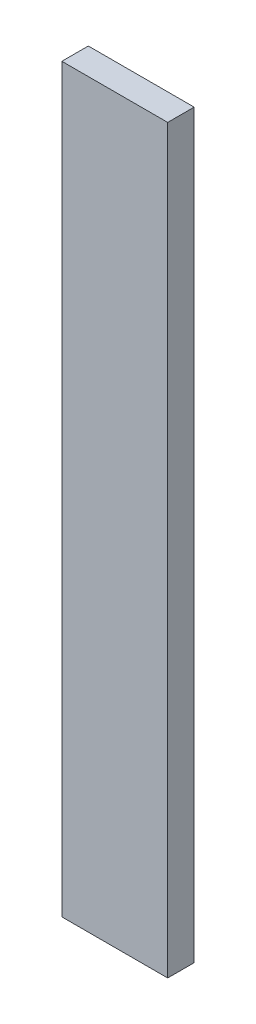
ISO-10303-21;
HEADER;
FILE_DESCRIPTION(('STEP AP214'),'2;1');
FILE_NAME('part.step','',(''),(''),'','','');
FILE_SCHEMA(('AUTOMOTIVE_DESIGN { 1 0 10303 214 1 1 1 1 }'));
ENDSEC;
DATA;
#1=APPLICATION_CONTEXT('core data for automotive mechanical design processes');
#2=APPLICATION_PROTOCOL_DEFINITION('international standard','automotive_design',2000,#1);
#3=PRODUCT_CONTEXT('',#1,'mechanical');
#4=PRODUCT('Part','Part','',(#3));
#5=PRODUCT_RELATED_PRODUCT_CATEGORY('part','',(#4));
#6=PRODUCT_DEFINITION_FORMATION('','',#4);
#7=PRODUCT_DEFINITION_CONTEXT('part definition',#1,'design');
#8=PRODUCT_DEFINITION('design','',#6,#7);
#9=PRODUCT_DEFINITION_SHAPE('','',#8);
#10=(LENGTH_UNIT() NAMED_UNIT(*) SI_UNIT(.MILLI.,.METRE.));
#11=(NAMED_UNIT(*) PLANE_ANGLE_UNIT() SI_UNIT($,.RADIAN.));
#12=(NAMED_UNIT(*) SI_UNIT($,.STERADIAN.) SOLID_ANGLE_UNIT());
#13=UNCERTAINTY_MEASURE_WITH_UNIT(LENGTH_MEASURE(1.E-05),#10,'distance_accuracy_value','');
#14=(GEOMETRIC_REPRESENTATION_CONTEXT(3) GLOBAL_UNCERTAINTY_ASSIGNED_CONTEXT((#13)) GLOBAL_UNIT_ASSIGNED_CONTEXT((#10,
#11,#12)) REPRESENTATION_CONTEXT('',''));
#15=CARTESIAN_POINT('',(0.,0.,0.));
#16=DIRECTION('',(0.,0.,1.));
#17=DIRECTION('',(1.,0.,0.));
#18=AXIS2_PLACEMENT_3D('',#15,#16,#17);
#19=CARTESIAN_POINT('',(12.7,88.9,6.35));
#20=DIRECTION('',(-1.,0.,0.));
#21=DIRECTION('',(0.,-1.,0.));
#22=AXIS2_PLACEMENT_3D('',#19,#20,#21);
#23=PLANE('',#22);
#24=DIRECTION('',(0.,1.,0.));
#25=VECTOR('',#24,1.);
#26=CARTESIAN_POINT('',(12.7,88.9,0.));
#27=LINE('',#26,#25);
#28=CARTESIAN_POINT('',(12.7,-88.9,0.));
#29=VERTEX_POINT('',#28);
#30=CARTESIAN_POINT('',(12.7,88.9,0.));
#31=VERTEX_POINT('',#30);
#32=EDGE_CURVE('E107',#29,#31,#27,.T.);
#33=ORIENTED_EDGE('',*,*,#32,.T.);
#34=DIRECTION('',(0.,0.,-1.));
#35=VECTOR('',#34,1.);
#36=CARTESIAN_POINT('',(12.7,88.9,6.35));
#37=LINE('',#36,#35);
#38=CARTESIAN_POINT('',(12.7,88.9,6.35));
#39=VERTEX_POINT('',#38);
#40=EDGE_CURVE('E11',#39,#31,#37,.T.);
#41=ORIENTED_EDGE('',*,*,#40,.F.);
#42=DIRECTION('',(0.,1.,0.));
#43=VECTOR('',#42,1.);
#44=CARTESIAN_POINT('',(12.7,88.9,6.35));
#45=LINE('',#44,#43);
#46=CARTESIAN_POINT('',(12.7,-88.9,6.35));
#47=VERTEX_POINT('',#46);
#48=EDGE_CURVE('E91',#47,#39,#45,.T.);
#49=ORIENTED_EDGE('',*,*,#48,.F.);
#50=DIRECTION('',(0.,0.,-1.));
#51=VECTOR('',#50,1.);
#52=CARTESIAN_POINT('',(12.7,-88.9,6.35));
#53=LINE('',#52,#51);
#54=EDGE_CURVE('E103',#47,#29,#53,.T.);
#55=ORIENTED_EDGE('',*,*,#54,.T.);
#56=EDGE_LOOP('',(#33,#41,#49,#55));
#57=FACE_BOUND('',#56,.T.);
#58=ADVANCED_FACE('F39',(#57),#23,.F.);
#59=CARTESIAN_POINT('',(-12.7,88.9,6.35));
#60=DIRECTION('',(0.,-1.,0.));
#61=DIRECTION('',(0.,0.,-1.));
#62=AXIS2_PLACEMENT_3D('',#59,#60,#61);
#63=PLANE('',#62);
#64=DIRECTION('',(-1.,0.,0.));
#65=VECTOR('',#64,1.);
#66=CARTESIAN_POINT('',(-12.7,88.9,0.));
#67=LINE('',#66,#65);
#68=CARTESIAN_POINT('',(-12.7,88.9,0.));
#69=VERTEX_POINT('',#68);
#70=EDGE_CURVE('E96',#31,#69,#67,.T.);
#71=ORIENTED_EDGE('',*,*,#70,.T.);
#72=DIRECTION('',(0.,0.,-1.));
#73=VECTOR('',#72,1.);
#74=CARTESIAN_POINT('',(-12.7,88.9,6.35));
#75=LINE('',#74,#73);
#76=CARTESIAN_POINT('',(-12.7,88.9,6.35));
#77=VERTEX_POINT('',#76);
#78=EDGE_CURVE('E48',#77,#69,#75,.T.);
#79=ORIENTED_EDGE('',*,*,#78,.F.);
#80=DIRECTION('',(-1.,0.,0.));
#81=VECTOR('',#80,1.);
#82=CARTESIAN_POINT('',(-12.7,88.9,6.35));
#83=LINE('',#82,#81);
#84=EDGE_CURVE('E86',#39,#77,#83,.T.);
#85=ORIENTED_EDGE('',*,*,#84,.F.);
#86=ORIENTED_EDGE('',*,*,#40,.T.);
#87=EDGE_LOOP('',(#71,#79,#85,#86));
#88=FACE_BOUND('',#87,.T.);
#89=ADVANCED_FACE('F95',(#88),#63,.F.);
#90=CARTESIAN_POINT('',(-12.7,88.9,6.35));
#91=DIRECTION('',(1.,0.,0.));
#92=DIRECTION('',(0.,1.,0.));
#93=AXIS2_PLACEMENT_3D('',#90,#91,#92);
#94=PLANE('',#93);
#95=DIRECTION('',(0.,-1.,0.));
#96=VECTOR('',#95,1.);
#97=CARTESIAN_POINT('',(-12.7,88.9,0.));
#98=LINE('',#97,#96);
#99=CARTESIAN_POINT('',(-12.7,-88.9,0.));
#100=VERTEX_POINT('',#99);
#101=EDGE_CURVE('E73',#69,#100,#98,.T.);
#102=ORIENTED_EDGE('',*,*,#101,.T.);
#103=DIRECTION('',(0.,0.,-1.));
#104=VECTOR('',#103,1.);
#105=CARTESIAN_POINT('',(-12.7,-88.9,6.35));
#106=LINE('',#105,#104);
#107=CARTESIAN_POINT('',(-12.7,-88.9,6.35));
#108=VERTEX_POINT('',#107);
#109=EDGE_CURVE('E98',#108,#100,#106,.T.);
#110=ORIENTED_EDGE('',*,*,#109,.F.);
#111=DIRECTION('',(0.,-1.,0.));
#112=VECTOR('',#111,1.);
#113=CARTESIAN_POINT('',(-12.7,88.9,6.35));
#114=LINE('',#113,#112);
#115=EDGE_CURVE('E89',#77,#108,#114,.T.);
#116=ORIENTED_EDGE('',*,*,#115,.F.);
#117=ORIENTED_EDGE('',*,*,#78,.T.);
#118=EDGE_LOOP('',(#102,#110,#116,#117));
#119=FACE_BOUND('',#118,.T.);
#120=ADVANCED_FACE('F99',(#119),#94,.F.);
#121=CARTESIAN_POINT('',(-12.7,-88.9,6.35));
#122=DIRECTION('',(0.,1.,0.));
#123=DIRECTION('',(0.,0.,1.));
#124=AXIS2_PLACEMENT_3D('',#121,#122,#123);
#125=PLANE('',#124);
#126=DIRECTION('',(1.,0.,0.));
#127=VECTOR('',#126,1.);
#128=CARTESIAN_POINT('',(-12.7,-88.9,0.));
#129=LINE('',#128,#127);
#130=EDGE_CURVE('E79',#100,#29,#129,.T.);
#131=ORIENTED_EDGE('',*,*,#130,.T.);
#132=ORIENTED_EDGE('',*,*,#54,.F.);
#133=DIRECTION('',(1.,0.,0.));
#134=VECTOR('',#133,1.);
#135=CARTESIAN_POINT('',(-12.7,-88.9,6.35));
#136=LINE('',#135,#134);
#137=EDGE_CURVE('E56',#108,#47,#136,.T.);
#138=ORIENTED_EDGE('',*,*,#137,.F.);
#139=ORIENTED_EDGE('',*,*,#109,.T.);
#140=EDGE_LOOP('',(#131,#132,#138,#139));
#141=FACE_BOUND('',#140,.T.);
#142=ADVANCED_FACE('F120',(#141),#125,.F.);
#143=CARTESIAN_POINT('',(0.,0.,6.35));
#144=DIRECTION('',(0.,0.,1.));
#145=DIRECTION('',(1.,0.,0.));
#146=AXIS2_PLACEMENT_3D('',#143,#144,#145);
#147=PLANE('',#146);
#148=ORIENTED_EDGE('',*,*,#48,.T.);
#149=ORIENTED_EDGE('',*,*,#84,.T.);
#150=ORIENTED_EDGE('',*,*,#115,.T.);
#151=ORIENTED_EDGE('',*,*,#137,.T.);
#152=EDGE_LOOP('',(#148,#149,#150,#151));
#153=FACE_BOUND('',#152,.T.);
#154=ADVANCED_FACE('F87',(#153),#147,.T.);
#155=CARTESIAN_POINT('',(0.,0.,0.));
#156=DIRECTION('',(0.,0.,1.));
#157=DIRECTION('',(1.,0.,0.));
#158=AXIS2_PLACEMENT_3D('',#155,#156,#157);
#159=PLANE('',#158);
#160=ORIENTED_EDGE('',*,*,#32,.F.);
#161=ORIENTED_EDGE('',*,*,#130,.F.);
#162=ORIENTED_EDGE('',*,*,#101,.F.);
#163=ORIENTED_EDGE('',*,*,#70,.F.);
#164=EDGE_LOOP('',(#160,#161,#162,#163));
#165=FACE_BOUND('',#164,.T.);
#166=ADVANCED_FACE('F123',(#165),#159,.F.);
#167=CLOSED_SHELL('',(#58,#89,#120,#142,#154,#166));
#168=MANIFOLD_SOLID_BREP('B2',#167);
#169=ADVANCED_BREP_SHAPE_REPRESENTATION('',(#18,#168),#14);
#170=SHAPE_DEFINITION_REPRESENTATION(#9,#169);
ENDSEC;
END-ISO-10303-21;
